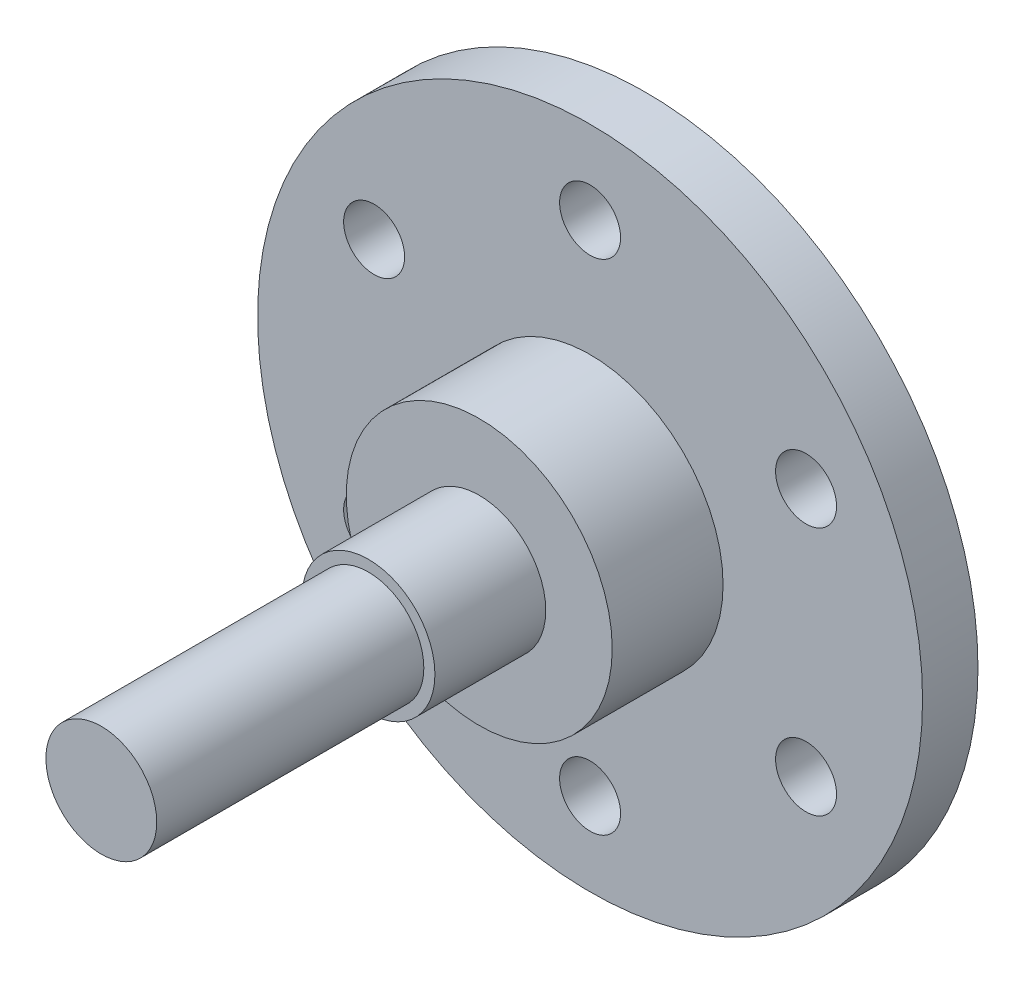
ISO-10303-21;
HEADER;
FILE_DESCRIPTION(('STEP AP214'),'2;1');
FILE_NAME('part.step','',(''),(''),'','','');
FILE_SCHEMA(('AUTOMOTIVE_DESIGN { 1 0 10303 214 1 1 1 1 }'));
ENDSEC;
DATA;
#1=APPLICATION_CONTEXT('core data for automotive mechanical design processes');
#2=APPLICATION_PROTOCOL_DEFINITION('international standard','automotive_design',2000,#1);
#3=PRODUCT_CONTEXT('',#1,'mechanical');
#4=PRODUCT('Part','Part','',(#3));
#5=PRODUCT_RELATED_PRODUCT_CATEGORY('part','',(#4));
#6=PRODUCT_DEFINITION_FORMATION('','',#4);
#7=PRODUCT_DEFINITION_CONTEXT('part definition',#1,'design');
#8=PRODUCT_DEFINITION('design','',#6,#7);
#9=PRODUCT_DEFINITION_SHAPE('','',#8);
#10=(LENGTH_UNIT() NAMED_UNIT(*) SI_UNIT(.MILLI.,.METRE.));
#11=(NAMED_UNIT(*) PLANE_ANGLE_UNIT() SI_UNIT($,.RADIAN.));
#12=(NAMED_UNIT(*) SI_UNIT($,.STERADIAN.) SOLID_ANGLE_UNIT());
#13=UNCERTAINTY_MEASURE_WITH_UNIT(LENGTH_MEASURE(1.E-05),#10,'distance_accuracy_value','');
#14=(GEOMETRIC_REPRESENTATION_CONTEXT(3) GLOBAL_UNCERTAINTY_ASSIGNED_CONTEXT((#13)) GLOBAL_UNIT_ASSIGNED_CONTEXT((#10,
#11,#12)) REPRESENTATION_CONTEXT('',''));
#15=CARTESIAN_POINT('',(0.,0.,0.));
#16=DIRECTION('',(0.,0.,1.));
#17=DIRECTION('',(1.,0.,0.));
#18=AXIS2_PLACEMENT_3D('',#15,#16,#17);
#19=CARTESIAN_POINT('',(0.,0.,5.));
#20=DIRECTION('',(0.,0.,1.));
#21=DIRECTION('',(1.,0.,0.));
#22=AXIS2_PLACEMENT_3D('',#19,#20,#21);
#23=PLANE('',#22);
#24=CARTESIAN_POINT('',(0.,0.,5.));
#25=DIRECTION('',(0.,0.,1.));
#26=DIRECTION('',(1.,0.,0.));
#27=AXIS2_PLACEMENT_3D('',#24,#25,#26);
#28=CIRCLE('',#27,12.);
#29=CARTESIAN_POINT('',(12.,0.,5.));
#30=VERTEX_POINT('',#29);
#31=EDGE_CURVE('E52',#30,#30,#28,.T.);
#32=ORIENTED_EDGE('',*,*,#31,.F.);
#33=EDGE_LOOP('',(#32));
#34=FACE_BOUND('',#33,.T.);
#35=CARTESIAN_POINT('',(-19.4855715851484,-11.2500000000008,5.));
#36=DIRECTION('',(0.,0.,1.));
#37=DIRECTION('',(1.,0.,0.));
#38=AXIS2_PLACEMENT_3D('',#35,#36,#37);
#39=CIRCLE('',#38,2.75000000000183);
#40=CARTESIAN_POINT('',(-16.7355715851466,-11.2500000000008,5.));
#41=VERTEX_POINT('',#40);
#42=EDGE_CURVE('E66',#41,#41,#39,.T.);
#43=ORIENTED_EDGE('',*,*,#42,.F.);
#44=EDGE_LOOP('',(#43));
#45=FACE_BOUND('',#44,.T.);
#46=CARTESIAN_POINT('',(19.4855715851513,-11.2499999999992,5.));
#47=DIRECTION('',(0.,0.,1.));
#48=DIRECTION('',(1.,0.,0.));
#49=AXIS2_PLACEMENT_3D('',#46,#47,#48);
#50=CIRCLE('',#49,2.75000000000123);
#51=CARTESIAN_POINT('',(22.2355715851525,-11.2499999999992,5.));
#52=VERTEX_POINT('',#51);
#53=EDGE_CURVE('E78',#52,#52,#50,.T.);
#54=ORIENTED_EDGE('',*,*,#53,.F.);
#55=EDGE_LOOP('',(#54));
#56=FACE_BOUND('',#55,.T.);
#57=CARTESIAN_POINT('',(0.,22.5,5.));
#58=DIRECTION('',(0.,0.,1.));
#59=DIRECTION('',(1.,0.,0.));
#60=AXIS2_PLACEMENT_3D('',#57,#58,#59);
#61=CIRCLE('',#60,2.75);
#62=CARTESIAN_POINT('',(2.75,22.5,5.));
#63=VERTEX_POINT('',#62);
#64=EDGE_CURVE('E90',#63,#63,#61,.T.);
#65=ORIENTED_EDGE('',*,*,#64,.F.);
#66=EDGE_LOOP('',(#65));
#67=FACE_BOUND('',#66,.T.);
#68=CARTESIAN_POINT('',(0.,0.,5.));
#69=DIRECTION('',(0.,0.,1.));
#70=DIRECTION('',(1.,0.,0.));
#71=AXIS2_PLACEMENT_3D('',#68,#69,#70);
#72=CIRCLE('',#71,30.);
#73=CARTESIAN_POINT('',(30.,0.,5.));
#74=VERTEX_POINT('',#73);
#75=EDGE_CURVE('E45',#74,#74,#72,.T.);
#76=ORIENTED_EDGE('',*,*,#75,.T.);
#77=EDGE_LOOP('',(#76));
#78=FACE_BOUND('',#77,.T.);
#79=CARTESIAN_POINT('',(19.4855715851503,11.2500000000008,5.));
#80=DIRECTION('',(0.,0.,1.));
#81=DIRECTION('',(1.,0.,0.));
#82=AXIS2_PLACEMENT_3D('',#79,#80,#81);
#83=CIRCLE('',#82,2.75000000000027);
#84=CARTESIAN_POINT('',(22.2355715851506,11.2500000000008,5.));
#85=VERTEX_POINT('',#84);
#86=EDGE_CURVE('E84',#85,#85,#83,.T.);
#87=ORIENTED_EDGE('',*,*,#86,.F.);
#88=EDGE_LOOP('',(#87));
#89=FACE_BOUND('',#88,.T.);
#90=CARTESIAN_POINT('',(1.91295447595611E-12,-22.5,5.));
#91=DIRECTION('',(0.,0.,1.));
#92=DIRECTION('',(1.,0.,0.));
#93=AXIS2_PLACEMENT_3D('',#90,#91,#92);
#94=CIRCLE('',#93,2.75000000000198);
#95=CARTESIAN_POINT('',(2.75000000000389,-22.5,5.));
#96=VERTEX_POINT('',#95);
#97=EDGE_CURVE('E72',#96,#96,#94,.T.);
#98=ORIENTED_EDGE('',*,*,#97,.F.);
#99=EDGE_LOOP('',(#98));
#100=FACE_BOUND('',#99,.T.);
#101=CARTESIAN_POINT('',(-19.4855715851494,11.2499999999992,5.));
#102=DIRECTION('',(0.,0.,1.));
#103=DIRECTION('',(1.,0.,0.));
#104=AXIS2_PLACEMENT_3D('',#101,#102,#103);
#105=CIRCLE('',#104,2.75000000000097);
#106=CARTESIAN_POINT('',(-16.7355715851484,11.2499999999992,5.));
#107=VERTEX_POINT('',#106);
#108=EDGE_CURVE('E60',#107,#107,#105,.T.);
#109=ORIENTED_EDGE('',*,*,#108,.F.);
#110=EDGE_LOOP('',(#109));
#111=FACE_BOUND('',#110,.T.);
#112=ADVANCED_FACE('F32',(#34,#45,#56,#67,#78,#89,#100,#111),#23,.T.);
#113=CARTESIAN_POINT('',(0.,0.,0.));
#114=DIRECTION('',(0.,0.,1.));
#115=DIRECTION('',(1.,0.,0.));
#116=AXIS2_PLACEMENT_3D('',#113,#114,#115);
#117=PLANE('',#116);
#118=CARTESIAN_POINT('',(0.,0.,0.));
#119=DIRECTION('',(0.,0.,1.));
#120=DIRECTION('',(1.,0.,0.));
#121=AXIS2_PLACEMENT_3D('',#118,#119,#120);
#122=CIRCLE('',#121,30.);
#123=CARTESIAN_POINT('',(30.,0.,0.));
#124=VERTEX_POINT('',#123);
#125=EDGE_CURVE('E36',#124,#124,#122,.T.);
#126=ORIENTED_EDGE('',*,*,#125,.F.);
#127=EDGE_LOOP('',(#126));
#128=FACE_BOUND('',#127,.T.);
#129=CARTESIAN_POINT('',(0.,22.5,0.));
#130=DIRECTION('',(0.,0.,1.));
#131=DIRECTION('',(1.,0.,0.));
#132=AXIS2_PLACEMENT_3D('',#129,#130,#131);
#133=CIRCLE('',#132,2.75);
#134=CARTESIAN_POINT('',(2.75,22.5,0.));
#135=VERTEX_POINT('',#134);
#136=EDGE_CURVE('E87',#135,#135,#133,.T.);
#137=ORIENTED_EDGE('',*,*,#136,.T.);
#138=EDGE_LOOP('',(#137));
#139=FACE_BOUND('',#138,.T.);
#140=CARTESIAN_POINT('',(19.4855715851503,11.2500000000008,0.));
#141=DIRECTION('',(0.,0.,1.));
#142=DIRECTION('',(1.,0.,0.));
#143=AXIS2_PLACEMENT_3D('',#140,#141,#142);
#144=CIRCLE('',#143,2.75000000000027);
#145=CARTESIAN_POINT('',(22.2355715851506,11.2500000000008,0.));
#146=VERTEX_POINT('',#145);
#147=EDGE_CURVE('E81',#146,#146,#144,.T.);
#148=ORIENTED_EDGE('',*,*,#147,.T.);
#149=EDGE_LOOP('',(#148));
#150=FACE_BOUND('',#149,.T.);
#151=CARTESIAN_POINT('',(19.4855715851513,-11.2499999999992,0.));
#152=DIRECTION('',(0.,0.,1.));
#153=DIRECTION('',(1.,0.,0.));
#154=AXIS2_PLACEMENT_3D('',#151,#152,#153);
#155=CIRCLE('',#154,2.75000000000123);
#156=CARTESIAN_POINT('',(22.2355715851525,-11.2499999999992,0.));
#157=VERTEX_POINT('',#156);
#158=EDGE_CURVE('E75',#157,#157,#155,.T.);
#159=ORIENTED_EDGE('',*,*,#158,.T.);
#160=EDGE_LOOP('',(#159));
#161=FACE_BOUND('',#160,.T.);
#162=CARTESIAN_POINT('',(1.91295447595611E-12,-22.5,0.));
#163=DIRECTION('',(0.,0.,1.));
#164=DIRECTION('',(1.,0.,0.));
#165=AXIS2_PLACEMENT_3D('',#162,#163,#164);
#166=CIRCLE('',#165,2.75000000000198);
#167=CARTESIAN_POINT('',(2.75000000000389,-22.5,0.));
#168=VERTEX_POINT('',#167);
#169=EDGE_CURVE('E69',#168,#168,#166,.T.);
#170=ORIENTED_EDGE('',*,*,#169,.T.);
#171=EDGE_LOOP('',(#170));
#172=FACE_BOUND('',#171,.T.);
#173=CARTESIAN_POINT('',(-19.4855715851484,-11.2500000000008,0.));
#174=DIRECTION('',(0.,0.,1.));
#175=DIRECTION('',(1.,0.,0.));
#176=AXIS2_PLACEMENT_3D('',#173,#174,#175);
#177=CIRCLE('',#176,2.75000000000183);
#178=CARTESIAN_POINT('',(-16.7355715851466,-11.2500000000008,0.));
#179=VERTEX_POINT('',#178);
#180=EDGE_CURVE('E63',#179,#179,#177,.T.);
#181=ORIENTED_EDGE('',*,*,#180,.T.);
#182=EDGE_LOOP('',(#181));
#183=FACE_BOUND('',#182,.T.);
#184=CARTESIAN_POINT('',(-19.4855715851494,11.2499999999992,0.));
#185=DIRECTION('',(0.,0.,1.));
#186=DIRECTION('',(1.,0.,0.));
#187=AXIS2_PLACEMENT_3D('',#184,#185,#186);
#188=CIRCLE('',#187,2.75000000000097);
#189=CARTESIAN_POINT('',(-16.7355715851484,11.2499999999992,0.));
#190=VERTEX_POINT('',#189);
#191=EDGE_CURVE('E57',#190,#190,#188,.T.);
#192=ORIENTED_EDGE('',*,*,#191,.T.);
#193=EDGE_LOOP('',(#192));
#194=FACE_BOUND('',#193,.T.);
#195=ADVANCED_FACE('F101',(#128,#139,#150,#161,#172,#183,#194),#117,.F.);
#196=CARTESIAN_POINT('',(0.,0.,5.));
#197=DIRECTION('',(0.,0.,-1.));
#198=DIRECTION('',(-1.,0.,0.));
#199=AXIS2_PLACEMENT_3D('',#196,#197,#198);
#200=CYLINDRICAL_SURFACE('',#199,30.);
#201=ORIENTED_EDGE('',*,*,#75,.F.);
#202=EDGE_LOOP('',(#201));
#203=FACE_BOUND('',#202,.T.);
#204=ORIENTED_EDGE('',*,*,#125,.T.);
#205=EDGE_LOOP('',(#204));
#206=FACE_BOUND('',#205,.T.);
#207=ADVANCED_FACE('F34',(#203,#206),#200,.T.);
#208=CARTESIAN_POINT('',(0.,22.5,5.));
#209=DIRECTION('',(0.,0.,-1.));
#210=DIRECTION('',(-1.,0.,0.));
#211=AXIS2_PLACEMENT_3D('',#208,#209,#210);
#212=CYLINDRICAL_SURFACE('',#211,2.75);
#213=ORIENTED_EDGE('',*,*,#64,.T.);
#214=EDGE_LOOP('',(#213));
#215=FACE_BOUND('',#214,.T.);
#216=ORIENTED_EDGE('',*,*,#136,.F.);
#217=EDGE_LOOP('',(#216));
#218=FACE_BOUND('',#217,.T.);
#219=ADVANCED_FACE('F140',(#215,#218),#212,.F.);
#220=CARTESIAN_POINT('',(19.4855715851503,11.2500000000008,5.));
#221=DIRECTION('',(0.,0.,-1.));
#222=DIRECTION('',(-1.,0.,0.));
#223=AXIS2_PLACEMENT_3D('',#220,#221,#222);
#224=CYLINDRICAL_SURFACE('',#223,2.75000000000027);
#225=ORIENTED_EDGE('',*,*,#86,.T.);
#226=EDGE_LOOP('',(#225));
#227=FACE_BOUND('',#226,.T.);
#228=ORIENTED_EDGE('',*,*,#147,.F.);
#229=EDGE_LOOP('',(#228));
#230=FACE_BOUND('',#229,.T.);
#231=ADVANCED_FACE('F143',(#227,#230),#224,.F.);
#232=CARTESIAN_POINT('',(19.4855715851513,-11.2499999999992,5.));
#233=DIRECTION('',(0.,0.,-1.));
#234=DIRECTION('',(-1.,0.,0.));
#235=AXIS2_PLACEMENT_3D('',#232,#233,#234);
#236=CYLINDRICAL_SURFACE('',#235,2.75000000000123);
#237=ORIENTED_EDGE('',*,*,#53,.T.);
#238=EDGE_LOOP('',(#237));
#239=FACE_BOUND('',#238,.T.);
#240=ORIENTED_EDGE('',*,*,#158,.F.);
#241=EDGE_LOOP('',(#240));
#242=FACE_BOUND('',#241,.T.);
#243=ADVANCED_FACE('F147',(#239,#242),#236,.F.);
#244=CARTESIAN_POINT('',(1.91295447595611E-12,-22.5,5.));
#245=DIRECTION('',(0.,0.,-1.));
#246=DIRECTION('',(-1.,0.,0.));
#247=AXIS2_PLACEMENT_3D('',#244,#245,#246);
#248=CYLINDRICAL_SURFACE('',#247,2.75000000000198);
#249=ORIENTED_EDGE('',*,*,#97,.T.);
#250=EDGE_LOOP('',(#249));
#251=FACE_BOUND('',#250,.T.);
#252=ORIENTED_EDGE('',*,*,#169,.F.);
#253=EDGE_LOOP('',(#252));
#254=FACE_BOUND('',#253,.T.);
#255=ADVANCED_FACE('F129',(#251,#254),#248,.F.);
#256=CARTESIAN_POINT('',(-19.4855715851484,-11.2500000000008,5.));
#257=DIRECTION('',(0.,0.,-1.));
#258=DIRECTION('',(-1.,0.,0.));
#259=AXIS2_PLACEMENT_3D('',#256,#257,#258);
#260=CYLINDRICAL_SURFACE('',#259,2.75000000000183);
#261=ORIENTED_EDGE('',*,*,#42,.T.);
#262=EDGE_LOOP('',(#261));
#263=FACE_BOUND('',#262,.T.);
#264=ORIENTED_EDGE('',*,*,#180,.F.);
#265=EDGE_LOOP('',(#264));
#266=FACE_BOUND('',#265,.T.);
#267=ADVANCED_FACE('F119',(#263,#266),#260,.F.);
#268=CARTESIAN_POINT('',(-19.4855715851494,11.2499999999992,5.));
#269=DIRECTION('',(0.,0.,-1.));
#270=DIRECTION('',(-1.,0.,0.));
#271=AXIS2_PLACEMENT_3D('',#268,#269,#270);
#272=CYLINDRICAL_SURFACE('',#271,2.75000000000097);
#273=ORIENTED_EDGE('',*,*,#108,.T.);
#274=EDGE_LOOP('',(#273));
#275=FACE_BOUND('',#274,.T.);
#276=ORIENTED_EDGE('',*,*,#191,.F.);
#277=EDGE_LOOP('',(#276));
#278=FACE_BOUND('',#277,.T.);
#279=ADVANCED_FACE('F116',(#275,#278),#272,.F.);
#280=CARTESIAN_POINT('',(0.,0.,15.));
#281=DIRECTION('',(0.,0.,-1.));
#282=DIRECTION('',(-1.,0.,0.));
#283=AXIS2_PLACEMENT_3D('',#280,#281,#282);
#284=CYLINDRICAL_SURFACE('',#283,12.);
#285=CARTESIAN_POINT('',(0.,0.,15.));
#286=DIRECTION('',(0.,0.,1.));
#287=DIRECTION('',(1.,0.,0.));
#288=AXIS2_PLACEMENT_3D('',#285,#286,#287);
#289=CIRCLE('',#288,12.);
#290=CARTESIAN_POINT('',(12.,0.,15.));
#291=VERTEX_POINT('',#290);
#292=EDGE_CURVE('E54',#291,#291,#289,.T.);
#293=ORIENTED_EDGE('',*,*,#292,.F.);
#294=EDGE_LOOP('',(#293));
#295=FACE_BOUND('',#294,.T.);
#296=ORIENTED_EDGE('',*,*,#31,.T.);
#297=EDGE_LOOP('',(#296));
#298=FACE_BOUND('',#297,.T.);
#299=ADVANCED_FACE('F118',(#295,#298),#284,.T.);
#300=CARTESIAN_POINT('',(0.,0.,15.));
#301=DIRECTION('',(0.,0.,1.));
#302=DIRECTION('',(1.,0.,0.));
#303=AXIS2_PLACEMENT_3D('',#300,#301,#302);
#304=PLANE('',#303);
#305=CARTESIAN_POINT('',(0.,0.,15.));
#306=DIRECTION('',(0.,0.,1.));
#307=DIRECTION('',(1.,0.,0.));
#308=AXIS2_PLACEMENT_3D('',#305,#306,#307);
#309=CIRCLE('',#308,6.);
#310=CARTESIAN_POINT('',(6.,0.,15.));
#311=VERTEX_POINT('',#310);
#312=EDGE_CURVE('E40',#311,#311,#309,.T.);
#313=ORIENTED_EDGE('',*,*,#312,.F.);
#314=EDGE_LOOP('',(#313));
#315=FACE_BOUND('',#314,.T.);
#316=ORIENTED_EDGE('',*,*,#292,.T.);
#317=EDGE_LOOP('',(#316));
#318=FACE_BOUND('',#317,.T.);
#319=ADVANCED_FACE('F126',(#315,#318),#304,.T.);
#320=CARTESIAN_POINT('',(0.,0.,25.));
#321=DIRECTION('',(0.,0.,-1.));
#322=DIRECTION('',(-1.,0.,0.));
#323=AXIS2_PLACEMENT_3D('',#320,#321,#322);
#324=CYLINDRICAL_SURFACE('',#323,6.);
#325=CARTESIAN_POINT('',(0.,0.,25.));
#326=DIRECTION('',(0.,0.,1.));
#327=DIRECTION('',(1.,0.,0.));
#328=AXIS2_PLACEMENT_3D('',#325,#326,#327);
#329=CIRCLE('',#328,6.);
#330=CARTESIAN_POINT('',(6.,0.,25.));
#331=VERTEX_POINT('',#330);
#332=EDGE_CURVE('E50',#331,#331,#329,.T.);
#333=ORIENTED_EDGE('',*,*,#332,.F.);
#334=EDGE_LOOP('',(#333));
#335=FACE_BOUND('',#334,.T.);
#336=ORIENTED_EDGE('',*,*,#312,.T.);
#337=EDGE_LOOP('',(#336));
#338=FACE_BOUND('',#337,.T.);
#339=ADVANCED_FACE('F191',(#335,#338),#324,.T.);
#340=CARTESIAN_POINT('',(0.,0.,25.));
#341=DIRECTION('',(0.,0.,1.));
#342=DIRECTION('',(1.,0.,0.));
#343=AXIS2_PLACEMENT_3D('',#340,#341,#342);
#344=PLANE('',#343);
#345=CARTESIAN_POINT('',(0.,0.,25.));
#346=DIRECTION('',(0.,0.,1.));
#347=DIRECTION('',(1.,0.,0.));
#348=AXIS2_PLACEMENT_3D('',#345,#346,#347);
#349=CIRCLE('',#348,5.);
#350=CARTESIAN_POINT('',(5.,0.,25.));
#351=VERTEX_POINT('',#350);
#352=EDGE_CURVE('E10',#351,#351,#349,.T.);
#353=ORIENTED_EDGE('',*,*,#352,.F.);
#354=EDGE_LOOP('',(#353));
#355=FACE_BOUND('',#354,.T.);
#356=ORIENTED_EDGE('',*,*,#332,.T.);
#357=EDGE_LOOP('',(#356));
#358=FACE_BOUND('',#357,.T.);
#359=ADVANCED_FACE('F201',(#355,#358),#344,.T.);
#360=CARTESIAN_POINT('',(0.,0.,49.1));
#361=DIRECTION('',(0.,0.,-1.));
#362=DIRECTION('',(-1.,0.,0.));
#363=AXIS2_PLACEMENT_3D('',#360,#361,#362);
#364=CYLINDRICAL_SURFACE('',#363,5.);
#365=CARTESIAN_POINT('',(0.,0.,49.1));
#366=DIRECTION('',(0.,0.,1.));
#367=DIRECTION('',(1.,0.,0.));
#368=AXIS2_PLACEMENT_3D('',#365,#366,#367);
#369=CIRCLE('',#368,5.);
#370=CARTESIAN_POINT('',(5.,0.,49.1));
#371=VERTEX_POINT('',#370);
#372=EDGE_CURVE('E49',#371,#371,#369,.T.);
#373=ORIENTED_EDGE('',*,*,#372,.F.);
#374=EDGE_LOOP('',(#373));
#375=FACE_BOUND('',#374,.T.);
#376=ORIENTED_EDGE('',*,*,#352,.T.);
#377=EDGE_LOOP('',(#376));
#378=FACE_BOUND('',#377,.T.);
#379=ADVANCED_FACE('F211',(#375,#378),#364,.T.);
#380=CARTESIAN_POINT('',(0.,0.,49.1));
#381=DIRECTION('',(0.,0.,1.));
#382=DIRECTION('',(1.,0.,0.));
#383=AXIS2_PLACEMENT_3D('',#380,#381,#382);
#384=PLANE('',#383);
#385=ORIENTED_EDGE('',*,*,#372,.T.);
#386=EDGE_LOOP('',(#385));
#387=FACE_BOUND('',#386,.T.);
#388=ADVANCED_FACE('F221',(#387),#384,.T.);
#389=CLOSED_SHELL('',(#112,#195,#207,#219,#231,#243,#255,#267,#279,#299,#319,#339,#359,#379,#388));
#390=MANIFOLD_SOLID_BREP('B2',#389);
#391=ADVANCED_BREP_SHAPE_REPRESENTATION('',(#18,#390),#14);
#392=SHAPE_DEFINITION_REPRESENTATION(#9,#391);
ENDSEC;
END-ISO-10303-21;
